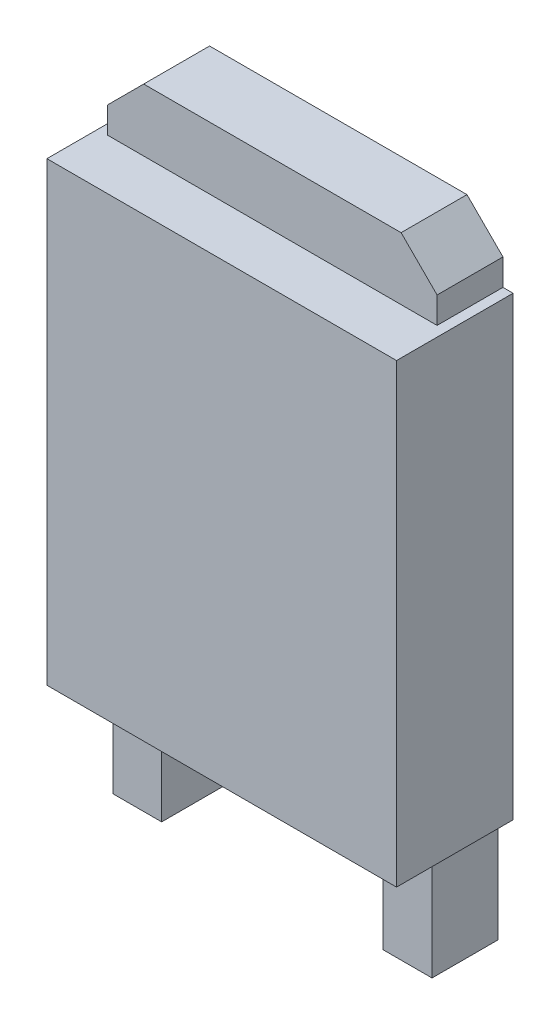
ISO-10303-21;
HEADER;
FILE_DESCRIPTION(('STEP AP214'),'2;1');
FILE_NAME('part.step','',(''),(''),'','','');
FILE_SCHEMA(('AUTOMOTIVE_DESIGN { 1 0 10303 214 1 1 1 1 }'));
ENDSEC;
DATA;
#1=APPLICATION_CONTEXT('core data for automotive mechanical design processes');
#2=APPLICATION_PROTOCOL_DEFINITION('international standard','automotive_design',2000,#1);
#3=PRODUCT_CONTEXT('',#1,'mechanical');
#4=PRODUCT('Part','Part','',(#3));
#5=PRODUCT_RELATED_PRODUCT_CATEGORY('part','',(#4));
#6=PRODUCT_DEFINITION_FORMATION('','',#4);
#7=PRODUCT_DEFINITION_CONTEXT('part definition',#1,'design');
#8=PRODUCT_DEFINITION('design','',#6,#7);
#9=PRODUCT_DEFINITION_SHAPE('','',#8);
#10=(LENGTH_UNIT() NAMED_UNIT(*) SI_UNIT(.MILLI.,.METRE.));
#11=(NAMED_UNIT(*) PLANE_ANGLE_UNIT() SI_UNIT($,.RADIAN.));
#12=(NAMED_UNIT(*) SI_UNIT($,.STERADIAN.) SOLID_ANGLE_UNIT());
#13=UNCERTAINTY_MEASURE_WITH_UNIT(LENGTH_MEASURE(1.E-05),#10,'distance_accuracy_value','');
#14=(GEOMETRIC_REPRESENTATION_CONTEXT(3) GLOBAL_UNCERTAINTY_ASSIGNED_CONTEXT((#13)) GLOBAL_UNIT_ASSIGNED_CONTEXT((#10,
#11,#12)) REPRESENTATION_CONTEXT('',''));
#15=CARTESIAN_POINT('',(0.,0.,0.));
#16=DIRECTION('',(0.,0.,1.));
#17=DIRECTION('',(1.,0.,0.));
#18=AXIS2_PLACEMENT_3D('',#15,#16,#17);
#19=CARTESIAN_POINT('',(0.,0.,0.));
#20=DIRECTION('',(0.,0.,-1.));
#21=DIRECTION('',(-1.,0.,0.));
#22=AXIS2_PLACEMENT_3D('',#19,#20,#21);
#23=PLANE('',#22);
#24=DIRECTION('',(1.,0.,0.));
#25=VECTOR('',#24,1.);
#26=CARTESIAN_POINT('',(-3.45,-4.5,0.));
#27=LINE('',#26,#25);
#28=CARTESIAN_POINT('',(-2.18529638091924,-4.5,0.));
#29=VERTEX_POINT('',#28);
#30=CARTESIAN_POINT('',(2.18529638091924,-4.5,0.));
#31=VERTEX_POINT('',#30);
#32=EDGE_CURVE('E346',#29,#31,#27,.T.);
#33=ORIENTED_EDGE('',*,*,#32,.F.);
#34=DIRECTION('',(1.,0.,0.));
#35=VECTOR('',#34,1.);
#36=CARTESIAN_POINT('',(-2.18529638091924,-4.5,0.));
#37=LINE('',#36,#35);
#38=CARTESIAN_POINT('',(-3.15,-4.5,0.));
#39=VERTEX_POINT('',#38);
#40=EDGE_CURVE('E204',#39,#29,#37,.T.);
#41=ORIENTED_EDGE('',*,*,#40,.F.);
#42=CARTESIAN_POINT('',(-3.45,-4.5,0.));
#43=VERTEX_POINT('',#42);
#44=EDGE_CURVE('E329',#43,#39,#27,.T.);
#45=ORIENTED_EDGE('',*,*,#44,.F.);
#46=DIRECTION('',(0.,-1.,0.));
#47=VECTOR('',#46,1.);
#48=CARTESIAN_POINT('',(-3.45,-4.5,0.));
#49=LINE('',#48,#47);
#50=CARTESIAN_POINT('',(-3.45,4.5,0.));
#51=VERTEX_POINT('',#50);
#52=EDGE_CURVE('E342',#51,#43,#49,.T.);
#53=ORIENTED_EDGE('',*,*,#52,.F.);
#54=DIRECTION('',(-1.,0.,0.));
#55=VECTOR('',#54,1.);
#56=CARTESIAN_POINT('',(-3.45,4.5,0.));
#57=LINE('',#56,#55);
#58=CARTESIAN_POINT('',(-3.25,4.5,0.));
#59=VERTEX_POINT('',#58);
#60=EDGE_CURVE('E338',#59,#51,#57,.T.);
#61=ORIENTED_EDGE('',*,*,#60,.F.);
#62=DIRECTION('',(-1.,0.,0.));
#63=VECTOR('',#62,1.);
#64=CARTESIAN_POINT('',(-3.25,4.5,0.));
#65=LINE('',#64,#63);
#66=CARTESIAN_POINT('',(3.25,4.5,0.));
#67=VERTEX_POINT('',#66);
#68=EDGE_CURVE('E235',#67,#59,#65,.T.);
#69=ORIENTED_EDGE('',*,*,#68,.F.);
#70=CARTESIAN_POINT('',(3.45,4.5,0.));
#71=VERTEX_POINT('',#70);
#72=EDGE_CURVE('E339',#71,#67,#57,.T.);
#73=ORIENTED_EDGE('',*,*,#72,.F.);
#74=DIRECTION('',(0.,1.,0.));
#75=VECTOR('',#74,1.);
#76=CARTESIAN_POINT('',(3.45,-4.5,0.));
#77=LINE('',#76,#75);
#78=CARTESIAN_POINT('',(3.45,-4.5,0.));
#79=VERTEX_POINT('',#78);
#80=EDGE_CURVE('E314',#79,#71,#77,.T.);
#81=ORIENTED_EDGE('',*,*,#80,.F.);
#82=CARTESIAN_POINT('',(3.15,-4.5,0.));
#83=VERTEX_POINT('',#82);
#84=EDGE_CURVE('E344',#83,#79,#27,.T.);
#85=ORIENTED_EDGE('',*,*,#84,.F.);
#86=DIRECTION('',(1.,0.,0.));
#87=VECTOR('',#86,1.);
#88=CARTESIAN_POINT('',(3.15,-4.5,0.));
#89=LINE('',#88,#87);
#90=EDGE_CURVE('E216',#31,#83,#89,.T.);
#91=ORIENTED_EDGE('',*,*,#90,.F.);
#92=EDGE_LOOP('',(#33,#41,#45,#53,#61,#69,#73,#81,#85,#91));
#93=FACE_BOUND('',#92,.T.);
#94=ADVANCED_FACE('F36',(#93),#23,.T.);
#95=CARTESIAN_POINT('',(-3.45,-4.5,2.3));
#96=DIRECTION('',(0.,1.,0.));
#97=DIRECTION('',(0.,0.,1.));
#98=AXIS2_PLACEMENT_3D('',#95,#96,#97);
#99=PLANE('',#98);
#100=ORIENTED_EDGE('',*,*,#44,.T.);
#101=DIRECTION('',(0.,0.,-1.));
#102=VECTOR('',#101,1.);
#103=CARTESIAN_POINT('',(-3.15,-4.5,1.3));
#104=LINE('',#103,#102);
#105=CARTESIAN_POINT('',(-3.15,-4.5,1.3));
#106=VERTEX_POINT('',#105);
#107=EDGE_CURVE('E56',#106,#39,#104,.T.);
#108=ORIENTED_EDGE('',*,*,#107,.F.);
#109=DIRECTION('',(1.,0.,0.));
#110=VECTOR('',#109,1.);
#111=CARTESIAN_POINT('',(-3.15,-4.5,1.3));
#112=LINE('',#111,#110);
#113=CARTESIAN_POINT('',(-2.18529638091924,-4.5,1.3));
#114=VERTEX_POINT('',#113);
#115=EDGE_CURVE('E51',#106,#114,#112,.T.);
#116=ORIENTED_EDGE('',*,*,#115,.T.);
#117=DIRECTION('',(0.,0.,-1.));
#118=VECTOR('',#117,1.);
#119=CARTESIAN_POINT('',(-2.18529638091924,-4.5,1.3));
#120=LINE('',#119,#118);
#121=EDGE_CURVE('E191',#114,#29,#120,.T.);
#122=ORIENTED_EDGE('',*,*,#121,.T.);
#123=ORIENTED_EDGE('',*,*,#32,.T.);
#124=DIRECTION('',(0.,0.,-1.));
#125=VECTOR('',#124,1.);
#126=CARTESIAN_POINT('',(2.18529638091924,-4.5,1.3));
#127=LINE('',#126,#125);
#128=CARTESIAN_POINT('',(2.18529638091924,-4.5,1.3));
#129=VERTEX_POINT('',#128);
#130=EDGE_CURVE('E284',#129,#31,#127,.T.);
#131=ORIENTED_EDGE('',*,*,#130,.F.);
#132=DIRECTION('',(1.,0.,0.));
#133=VECTOR('',#132,1.);
#134=CARTESIAN_POINT('',(3.15,-4.5,1.3));
#135=LINE('',#134,#133);
#136=CARTESIAN_POINT('',(3.15,-4.5,1.3));
#137=VERTEX_POINT('',#136);
#138=EDGE_CURVE('E269',#129,#137,#135,.T.);
#139=ORIENTED_EDGE('',*,*,#138,.T.);
#140=DIRECTION('',(0.,0.,-1.));
#141=VECTOR('',#140,1.);
#142=CARTESIAN_POINT('',(3.15,-4.5,1.3));
#143=LINE('',#142,#141);
#144=EDGE_CURVE('E283',#137,#83,#143,.T.);
#145=ORIENTED_EDGE('',*,*,#144,.T.);
#146=ORIENTED_EDGE('',*,*,#84,.T.);
#147=DIRECTION('',(0.,0.,-1.));
#148=VECTOR('',#147,1.);
#149=CARTESIAN_POINT('',(3.45,-4.5,2.3));
#150=LINE('',#149,#148);
#151=CARTESIAN_POINT('',(3.45,-4.5,2.3));
#152=VERTEX_POINT('',#151);
#153=EDGE_CURVE('E335',#152,#79,#150,.T.);
#154=ORIENTED_EDGE('',*,*,#153,.F.);
#155=DIRECTION('',(1.,0.,0.));
#156=VECTOR('',#155,1.);
#157=CARTESIAN_POINT('',(-3.45,-4.5,2.3));
#158=LINE('',#157,#156);
#159=CARTESIAN_POINT('',(-3.45,-4.5,2.3));
#160=VERTEX_POINT('',#159);
#161=EDGE_CURVE('E333',#160,#152,#158,.T.);
#162=ORIENTED_EDGE('',*,*,#161,.F.);
#163=DIRECTION('',(0.,0.,-1.));
#164=VECTOR('',#163,1.);
#165=CARTESIAN_POINT('',(-3.45,-4.5,2.3));
#166=LINE('',#165,#164);
#167=EDGE_CURVE('E349',#160,#43,#166,.T.);
#168=ORIENTED_EDGE('',*,*,#167,.T.);
#169=EDGE_LOOP('',(#100,#108,#116,#122,#123,#131,#139,#145,#146,#154,#162,#168));
#170=FACE_BOUND('',#169,.T.);
#171=ADVANCED_FACE('F361',(#170),#99,.F.);
#172=CARTESIAN_POINT('',(-3.45,4.5,2.3));
#173=DIRECTION('',(0.,-1.,0.));
#174=DIRECTION('',(0.,0.,-1.));
#175=AXIS2_PLACEMENT_3D('',#172,#173,#174);
#176=PLANE('',#175);
#177=DIRECTION('',(0.,0.,-1.));
#178=VECTOR('',#177,1.);
#179=CARTESIAN_POINT('',(3.25,4.5,1.3));
#180=LINE('',#179,#178);
#181=CARTESIAN_POINT('',(3.25,4.5,1.3));
#182=VERTEX_POINT('',#181);
#183=EDGE_CURVE('E311',#182,#67,#180,.T.);
#184=ORIENTED_EDGE('',*,*,#183,.F.);
#185=DIRECTION('',(-1.,0.,0.));
#186=VECTOR('',#185,1.);
#187=CARTESIAN_POINT('',(3.25,4.5,1.3));
#188=LINE('',#187,#186);
#189=CARTESIAN_POINT('',(-3.25,4.5,1.3));
#190=VERTEX_POINT('',#189);
#191=EDGE_CURVE('E287',#182,#190,#188,.T.);
#192=ORIENTED_EDGE('',*,*,#191,.T.);
#193=DIRECTION('',(0.,0.,-1.));
#194=VECTOR('',#193,1.);
#195=CARTESIAN_POINT('',(-3.25,4.5,1.3));
#196=LINE('',#195,#194);
#197=EDGE_CURVE('E310',#190,#59,#196,.T.);
#198=ORIENTED_EDGE('',*,*,#197,.T.);
#199=ORIENTED_EDGE('',*,*,#60,.T.);
#200=DIRECTION('',(0.,0.,-1.));
#201=VECTOR('',#200,1.);
#202=CARTESIAN_POINT('',(-3.45,4.5,2.3));
#203=LINE('',#202,#201);
#204=CARTESIAN_POINT('',(-3.45,4.5,2.3));
#205=VERTEX_POINT('',#204);
#206=EDGE_CURVE('E44',#205,#51,#203,.T.);
#207=ORIENTED_EDGE('',*,*,#206,.F.);
#208=DIRECTION('',(-1.,0.,0.));
#209=VECTOR('',#208,1.);
#210=CARTESIAN_POINT('',(-3.45,4.5,2.3));
#211=LINE('',#210,#209);
#212=CARTESIAN_POINT('',(3.45,4.5,2.3));
#213=VERTEX_POINT('',#212);
#214=EDGE_CURVE('E328',#213,#205,#211,.T.);
#215=ORIENTED_EDGE('',*,*,#214,.F.);
#216=DIRECTION('',(0.,0.,-1.));
#217=VECTOR('',#216,1.);
#218=CARTESIAN_POINT('',(3.45,4.5,2.3));
#219=LINE('',#218,#217);
#220=EDGE_CURVE('E11',#213,#71,#219,.T.);
#221=ORIENTED_EDGE('',*,*,#220,.T.);
#222=ORIENTED_EDGE('',*,*,#72,.T.);
#223=EDGE_LOOP('',(#184,#192,#198,#199,#207,#215,#221,#222));
#224=FACE_BOUND('',#223,.T.);
#225=ADVANCED_FACE('F389',(#224),#176,.F.);
#226=CARTESIAN_POINT('',(3.45,-4.5,2.3));
#227=DIRECTION('',(-1.,0.,0.));
#228=DIRECTION('',(0.,0.,1.));
#229=AXIS2_PLACEMENT_3D('',#226,#227,#228);
#230=PLANE('',#229);
#231=ORIENTED_EDGE('',*,*,#80,.T.);
#232=ORIENTED_EDGE('',*,*,#220,.F.);
#233=DIRECTION('',(0.,1.,0.));
#234=VECTOR('',#233,1.);
#235=CARTESIAN_POINT('',(3.45,-4.5,2.3));
#236=LINE('',#235,#234);
#237=EDGE_CURVE('E325',#152,#213,#236,.T.);
#238=ORIENTED_EDGE('',*,*,#237,.F.);
#239=ORIENTED_EDGE('',*,*,#153,.T.);
#240=EDGE_LOOP('',(#231,#232,#238,#239));
#241=FACE_BOUND('',#240,.T.);
#242=ADVANCED_FACE('F38',(#241),#230,.F.);
#243=CARTESIAN_POINT('',(-3.45,-4.5,2.3));
#244=DIRECTION('',(1.,0.,0.));
#245=DIRECTION('',(0.,0.,-1.));
#246=AXIS2_PLACEMENT_3D('',#243,#244,#245);
#247=PLANE('',#246);
#248=ORIENTED_EDGE('',*,*,#52,.T.);
#249=ORIENTED_EDGE('',*,*,#167,.F.);
#250=DIRECTION('',(0.,-1.,0.));
#251=VECTOR('',#250,1.);
#252=CARTESIAN_POINT('',(-3.45,-4.5,2.3));
#253=LINE('',#252,#251);
#254=EDGE_CURVE('E331',#205,#160,#253,.T.);
#255=ORIENTED_EDGE('',*,*,#254,.F.);
#256=ORIENTED_EDGE('',*,*,#206,.T.);
#257=EDGE_LOOP('',(#248,#249,#255,#256));
#258=FACE_BOUND('',#257,.T.);
#259=ADVANCED_FACE('F356',(#258),#247,.F.);
#260=CARTESIAN_POINT('',(0.,0.,2.3));
#261=DIRECTION('',(0.,0.,-1.));
#262=DIRECTION('',(-1.,0.,0.));
#263=AXIS2_PLACEMENT_3D('',#260,#261,#262);
#264=PLANE('',#263);
#265=ORIENTED_EDGE('',*,*,#237,.T.);
#266=ORIENTED_EDGE('',*,*,#214,.T.);
#267=ORIENTED_EDGE('',*,*,#254,.T.);
#268=ORIENTED_EDGE('',*,*,#161,.T.);
#269=EDGE_LOOP('',(#265,#266,#267,#268));
#270=FACE_BOUND('',#269,.T.);
#271=ADVANCED_FACE('F392',(#270),#264,.F.);
#272=CARTESIAN_POINT('',(3.25,5.02042326251558,1.3));
#273=DIRECTION('',(1.,0.,0.));
#274=DIRECTION('',(0.,0.,-1.));
#275=AXIS2_PLACEMENT_3D('',#272,#273,#274);
#276=PLANE('',#275);
#277=ORIENTED_EDGE('',*,*,#183,.T.);
#278=DIRECTION('',(0.,0.,1.));
#279=VECTOR('',#278,1.);
#280=CARTESIAN_POINT('',(3.25,4.5,-0.0001));
#281=LINE('',#280,#279);
#282=CARTESIAN_POINT('',(3.25,4.5,-0.0001));
#283=VERTEX_POINT('',#282);
#284=EDGE_CURVE('E253',#283,#67,#281,.T.);
#285=ORIENTED_EDGE('',*,*,#284,.F.);
#286=DIRECTION('',(0.,-1.,0.));
#287=VECTOR('',#286,1.);
#288=CARTESIAN_POINT('',(3.25,4.5,-0.0001));
#289=LINE('',#288,#287);
#290=CARTESIAN_POINT('',(3.25,5.02042326251558,-0.0001));
#291=VERTEX_POINT('',#290);
#292=EDGE_CURVE('E251',#291,#283,#289,.T.);
#293=ORIENTED_EDGE('',*,*,#292,.F.);
#294=DIRECTION('',(0.,0.,-1.));
#295=VECTOR('',#294,1.);
#296=CARTESIAN_POINT('',(3.25,5.02042326251558,1.3));
#297=LINE('',#296,#295);
#298=CARTESIAN_POINT('',(3.25,5.02042326251558,1.3));
#299=VERTEX_POINT('',#298);
#300=EDGE_CURVE('E315',#299,#291,#297,.T.);
#301=ORIENTED_EDGE('',*,*,#300,.F.);
#302=DIRECTION('',(0.,-1.,0.));
#303=VECTOR('',#302,1.);
#304=CARTESIAN_POINT('',(3.25,5.02042326251558,1.3));
#305=LINE('',#304,#303);
#306=EDGE_CURVE('E307',#299,#182,#305,.T.);
#307=ORIENTED_EDGE('',*,*,#306,.T.);
#308=EDGE_LOOP('',(#277,#285,#293,#301,#307));
#309=FACE_BOUND('',#308,.T.);
#310=ADVANCED_FACE('F404',(#309),#276,.T.);
#311=CARTESIAN_POINT('',(2.54,5.73042326251558,1.3));
#312=DIRECTION('',(0.707106781186547,0.707106781186548,0.));
#313=DIRECTION('',(-0.707106781186548,0.707106781186547,0.));
#314=AXIS2_PLACEMENT_3D('',#311,#312,#313);
#315=PLANE('',#314);
#316=ORIENTED_EDGE('',*,*,#300,.T.);
#317=DIRECTION('',(0.707106781186548,-0.707106781186547,0.));
#318=VECTOR('',#317,1.);
#319=CARTESIAN_POINT('',(3.25,5.02042326251558,-0.0001));
#320=LINE('',#319,#318);
#321=CARTESIAN_POINT('',(2.54,5.73042326251558,-0.0001));
#322=VERTEX_POINT('',#321);
#323=EDGE_CURVE('E248',#322,#291,#320,.T.);
#324=ORIENTED_EDGE('',*,*,#323,.F.);
#325=DIRECTION('',(0.,0.,-1.));
#326=VECTOR('',#325,1.);
#327=CARTESIAN_POINT('',(2.54,5.73042326251558,1.3));
#328=LINE('',#327,#326);
#329=CARTESIAN_POINT('',(2.54,5.73042326251558,1.3));
#330=VERTEX_POINT('',#329);
#331=EDGE_CURVE('E317',#330,#322,#328,.T.);
#332=ORIENTED_EDGE('',*,*,#331,.F.);
#333=DIRECTION('',(0.707106781186548,-0.707106781186547,0.));
#334=VECTOR('',#333,1.);
#335=CARTESIAN_POINT('',(2.54,5.73042326251558,1.3));
#336=LINE('',#335,#334);
#337=EDGE_CURVE('E304',#330,#299,#336,.T.);
#338=ORIENTED_EDGE('',*,*,#337,.T.);
#339=EDGE_LOOP('',(#316,#324,#332,#338));
#340=FACE_BOUND('',#339,.T.);
#341=ADVANCED_FACE('F458',(#340),#315,.T.);
#342=CARTESIAN_POINT('',(-2.54,5.73042326251558,1.3));
#343=DIRECTION('',(0.,1.,0.));
#344=DIRECTION('',(-1.,0.,0.));
#345=AXIS2_PLACEMENT_3D('',#342,#343,#344);
#346=PLANE('',#345);
#347=ORIENTED_EDGE('',*,*,#331,.T.);
#348=DIRECTION('',(1.,0.,0.));
#349=VECTOR('',#348,1.);
#350=CARTESIAN_POINT('',(2.54,5.73042326251558,-0.0001));
#351=LINE('',#350,#349);
#352=CARTESIAN_POINT('',(-2.54,5.73042326251558,-0.0001));
#353=VERTEX_POINT('',#352);
#354=EDGE_CURVE('E245',#353,#322,#351,.T.);
#355=ORIENTED_EDGE('',*,*,#354,.F.);
#356=DIRECTION('',(0.,0.,-1.));
#357=VECTOR('',#356,1.);
#358=CARTESIAN_POINT('',(-2.54,5.73042326251558,1.3));
#359=LINE('',#358,#357);
#360=CARTESIAN_POINT('',(-2.54,5.73042326251558,1.3));
#361=VERTEX_POINT('',#360);
#362=EDGE_CURVE('E319',#361,#353,#359,.T.);
#363=ORIENTED_EDGE('',*,*,#362,.F.);
#364=DIRECTION('',(1.,0.,0.));
#365=VECTOR('',#364,1.);
#366=CARTESIAN_POINT('',(-2.54,5.73042326251558,1.3));
#367=LINE('',#366,#365);
#368=EDGE_CURVE('E301',#361,#330,#367,.T.);
#369=ORIENTED_EDGE('',*,*,#368,.T.);
#370=EDGE_LOOP('',(#347,#355,#363,#369));
#371=FACE_BOUND('',#370,.T.);
#372=ADVANCED_FACE('F461',(#371),#346,.T.);
#373=CARTESIAN_POINT('',(-3.25,5.02042326251558,1.3));
#374=DIRECTION('',(-0.707106781186548,0.707106781186548,0.));
#375=DIRECTION('',(-0.707106781186548,-0.707106781186548,0.));
#376=AXIS2_PLACEMENT_3D('',#373,#374,#375);
#377=PLANE('',#376);
#378=ORIENTED_EDGE('',*,*,#362,.T.);
#379=DIRECTION('',(0.707106781186547,0.707106781186547,0.));
#380=VECTOR('',#379,1.);
#381=CARTESIAN_POINT('',(-2.54,5.73042326251558,-0.0001));
#382=LINE('',#381,#380);
#383=CARTESIAN_POINT('',(-3.25,5.02042326251558,-0.0001));
#384=VERTEX_POINT('',#383);
#385=EDGE_CURVE('E242',#384,#353,#382,.T.);
#386=ORIENTED_EDGE('',*,*,#385,.F.);
#387=DIRECTION('',(0.,0.,-1.));
#388=VECTOR('',#387,1.);
#389=CARTESIAN_POINT('',(-3.25,5.02042326251558,1.3));
#390=LINE('',#389,#388);
#391=CARTESIAN_POINT('',(-3.25,5.02042326251558,1.3));
#392=VERTEX_POINT('',#391);
#393=EDGE_CURVE('E321',#392,#384,#390,.T.);
#394=ORIENTED_EDGE('',*,*,#393,.F.);
#395=DIRECTION('',(0.707106781186547,0.707106781186547,0.));
#396=VECTOR('',#395,1.);
#397=CARTESIAN_POINT('',(-3.25,5.02042326251558,1.3));
#398=LINE('',#397,#396);
#399=EDGE_CURVE('E298',#392,#361,#398,.T.);
#400=ORIENTED_EDGE('',*,*,#399,.T.);
#401=EDGE_LOOP('',(#378,#386,#394,#400));
#402=FACE_BOUND('',#401,.T.);
#403=ADVANCED_FACE('F465',(#402),#377,.T.);
#404=CARTESIAN_POINT('',(-3.25,4.5,1.3));
#405=DIRECTION('',(-1.,0.,0.));
#406=DIRECTION('',(0.,0.,1.));
#407=AXIS2_PLACEMENT_3D('',#404,#405,#406);
#408=PLANE('',#407);
#409=ORIENTED_EDGE('',*,*,#393,.T.);
#410=DIRECTION('',(0.,1.,0.));
#411=VECTOR('',#410,1.);
#412=CARTESIAN_POINT('',(-3.25,5.02042326251558,-0.0001));
#413=LINE('',#412,#411);
#414=CARTESIAN_POINT('',(-3.25,4.5,-0.0001));
#415=VERTEX_POINT('',#414);
#416=EDGE_CURVE('E239',#415,#384,#413,.T.);
#417=ORIENTED_EDGE('',*,*,#416,.F.);
#418=DIRECTION('',(0.,0.,1.));
#419=VECTOR('',#418,1.);
#420=CARTESIAN_POINT('',(-3.25,4.5,-0.0001));
#421=LINE('',#420,#419);
#422=EDGE_CURVE('E258',#415,#59,#421,.T.);
#423=ORIENTED_EDGE('',*,*,#422,.T.);
#424=ORIENTED_EDGE('',*,*,#197,.F.);
#425=DIRECTION('',(0.,1.,0.));
#426=VECTOR('',#425,1.);
#427=CARTESIAN_POINT('',(-3.25,4.5,1.3));
#428=LINE('',#427,#426);
#429=EDGE_CURVE('E295',#190,#392,#428,.T.);
#430=ORIENTED_EDGE('',*,*,#429,.T.);
#431=EDGE_LOOP('',(#409,#417,#423,#424,#430));
#432=FACE_BOUND('',#431,.T.);
#433=ADVANCED_FACE('F415',(#432),#408,.T.);
#434=CARTESIAN_POINT('',(0.,0.,1.3));
#435=DIRECTION('',(0.,0.,-1.));
#436=DIRECTION('',(-1.,0.,0.));
#437=AXIS2_PLACEMENT_3D('',#434,#435,#436);
#438=PLANE('',#437);
#439=ORIENTED_EDGE('',*,*,#191,.F.);
#440=ORIENTED_EDGE('',*,*,#306,.F.);
#441=ORIENTED_EDGE('',*,*,#337,.F.);
#442=ORIENTED_EDGE('',*,*,#368,.F.);
#443=ORIENTED_EDGE('',*,*,#399,.F.);
#444=ORIENTED_EDGE('',*,*,#429,.F.);
#445=EDGE_LOOP('',(#439,#440,#441,#442,#443,#444));
#446=FACE_BOUND('',#445,.T.);
#447=ADVANCED_FACE('F410',(#446),#438,.F.);
#448=CARTESIAN_POINT('',(2.18529638091924,-6.70308501338229,1.3));
#449=DIRECTION('',(-1.,0.,0.));
#450=DIRECTION('',(0.,0.,1.));
#451=AXIS2_PLACEMENT_3D('',#448,#449,#450);
#452=PLANE('',#451);
#453=ORIENTED_EDGE('',*,*,#130,.T.);
#454=DIRECTION('',(0.,0.,1.));
#455=VECTOR('',#454,1.);
#456=CARTESIAN_POINT('',(2.18529638091924,-4.5,-0.0001));
#457=LINE('',#456,#455);
#458=CARTESIAN_POINT('',(2.18529638091924,-4.5,-0.0001));
#459=VERTEX_POINT('',#458);
#460=EDGE_CURVE('E232',#459,#31,#457,.T.);
#461=ORIENTED_EDGE('',*,*,#460,.F.);
#462=DIRECTION('',(0.,1.,0.));
#463=VECTOR('',#462,1.);
#464=CARTESIAN_POINT('',(2.18529638091924,-4.5,-0.0001));
#465=LINE('',#464,#463);
#466=CARTESIAN_POINT('',(2.18529638091924,-6.70308501338229,-0.0001));
#467=VERTEX_POINT('',#466);
#468=EDGE_CURVE('E223',#467,#459,#465,.T.);
#469=ORIENTED_EDGE('',*,*,#468,.F.);
#470=DIRECTION('',(0.,0.,-1.));
#471=VECTOR('',#470,1.);
#472=CARTESIAN_POINT('',(2.18529638091924,-6.70308501338229,1.3));
#473=LINE('',#472,#471);
#474=CARTESIAN_POINT('',(2.18529638091924,-6.70308501338229,1.3));
#475=VERTEX_POINT('',#474);
#476=EDGE_CURVE('E288',#475,#467,#473,.T.);
#477=ORIENTED_EDGE('',*,*,#476,.F.);
#478=DIRECTION('',(0.,1.,0.));
#479=VECTOR('',#478,1.);
#480=CARTESIAN_POINT('',(2.18529638091924,-6.70308501338229,1.3));
#481=LINE('',#480,#479);
#482=EDGE_CURVE('E280',#475,#129,#481,.T.);
#483=ORIENTED_EDGE('',*,*,#482,.T.);
#484=EDGE_LOOP('',(#453,#461,#469,#477,#483));
#485=FACE_BOUND('',#484,.T.);
#486=ADVANCED_FACE('F425',(#485),#452,.T.);
#487=CARTESIAN_POINT('',(3.15,-6.70308501338229,1.3));
#488=DIRECTION('',(0.,-1.,0.));
#489=DIRECTION('',(0.,0.,-1.));
#490=AXIS2_PLACEMENT_3D('',#487,#488,#489);
#491=PLANE('',#490);
#492=ORIENTED_EDGE('',*,*,#476,.T.);
#493=DIRECTION('',(-1.,0.,0.));
#494=VECTOR('',#493,1.);
#495=CARTESIAN_POINT('',(2.18529638091924,-6.70308501338229,-0.0001));
#496=LINE('',#495,#494);
#497=CARTESIAN_POINT('',(3.15,-6.70308501338229,-0.0001));
#498=VERTEX_POINT('',#497);
#499=EDGE_CURVE('E220',#498,#467,#496,.T.);
#500=ORIENTED_EDGE('',*,*,#499,.F.);
#501=DIRECTION('',(0.,0.,-1.));
#502=VECTOR('',#501,1.);
#503=CARTESIAN_POINT('',(3.15,-6.70308501338229,1.3));
#504=LINE('',#503,#502);
#505=CARTESIAN_POINT('',(3.15,-6.70308501338229,1.3));
#506=VERTEX_POINT('',#505);
#507=EDGE_CURVE('E290',#506,#498,#504,.T.);
#508=ORIENTED_EDGE('',*,*,#507,.F.);
#509=DIRECTION('',(-1.,0.,0.));
#510=VECTOR('',#509,1.);
#511=CARTESIAN_POINT('',(3.15,-6.70308501338229,1.3));
#512=LINE('',#511,#510);
#513=EDGE_CURVE('E277',#506,#475,#512,.T.);
#514=ORIENTED_EDGE('',*,*,#513,.T.);
#515=EDGE_LOOP('',(#492,#500,#508,#514));
#516=FACE_BOUND('',#515,.T.);
#517=ADVANCED_FACE('F438',(#516),#491,.T.);
#518=CARTESIAN_POINT('',(3.15,-4.5,1.3));
#519=DIRECTION('',(1.,0.,0.));
#520=DIRECTION('',(0.,0.,-1.));
#521=AXIS2_PLACEMENT_3D('',#518,#519,#520);
#522=PLANE('',#521);
#523=ORIENTED_EDGE('',*,*,#507,.T.);
#524=DIRECTION('',(0.,-1.,0.));
#525=VECTOR('',#524,1.);
#526=CARTESIAN_POINT('',(3.15,-6.70308501338229,-0.0001));
#527=LINE('',#526,#525);
#528=CARTESIAN_POINT('',(3.15,-4.5,-0.0001));
#529=VERTEX_POINT('',#528);
#530=EDGE_CURVE('E217',#529,#498,#527,.T.);
#531=ORIENTED_EDGE('',*,*,#530,.F.);
#532=DIRECTION('',(0.,0.,1.));
#533=VECTOR('',#532,1.);
#534=CARTESIAN_POINT('',(3.15,-4.5,-0.0001));
#535=LINE('',#534,#533);
#536=EDGE_CURVE('E227',#529,#83,#535,.T.);
#537=ORIENTED_EDGE('',*,*,#536,.T.);
#538=ORIENTED_EDGE('',*,*,#144,.F.);
#539=DIRECTION('',(0.,-1.,0.));
#540=VECTOR('',#539,1.);
#541=CARTESIAN_POINT('',(3.15,-4.5,1.3));
#542=LINE('',#541,#540);
#543=EDGE_CURVE('E274',#137,#506,#542,.T.);
#544=ORIENTED_EDGE('',*,*,#543,.T.);
#545=EDGE_LOOP('',(#523,#531,#537,#538,#544));
#546=FACE_BOUND('',#545,.T.);
#547=ADVANCED_FACE('F443',(#546),#522,.T.);
#548=CARTESIAN_POINT('',(0.,0.,1.3));
#549=DIRECTION('',(0.,0.,-1.));
#550=DIRECTION('',(-1.,0.,0.));
#551=AXIS2_PLACEMENT_3D('',#548,#549,#550);
#552=PLANE('',#551);
#553=ORIENTED_EDGE('',*,*,#138,.F.);
#554=ORIENTED_EDGE('',*,*,#482,.F.);
#555=ORIENTED_EDGE('',*,*,#513,.F.);
#556=ORIENTED_EDGE('',*,*,#543,.F.);
#557=EDGE_LOOP('',(#553,#554,#555,#556));
#558=FACE_BOUND('',#557,.T.);
#559=ADVANCED_FACE('F441',(#558),#552,.F.);
#560=CARTESIAN_POINT('',(-3.15,-4.5,1.3));
#561=DIRECTION('',(-1.,0.,0.));
#562=DIRECTION('',(0.,0.,1.));
#563=AXIS2_PLACEMENT_3D('',#560,#561,#562);
#564=PLANE('',#563);
#565=ORIENTED_EDGE('',*,*,#107,.T.);
#566=DIRECTION('',(0.,0.,1.));
#567=VECTOR('',#566,1.);
#568=CARTESIAN_POINT('',(-3.15,-4.5,-0.0001));
#569=LINE('',#568,#567);
#570=CARTESIAN_POINT('',(-3.15,-4.5,-0.0001));
#571=VERTEX_POINT('',#570);
#572=EDGE_CURVE('E213',#571,#39,#569,.T.);
#573=ORIENTED_EDGE('',*,*,#572,.F.);
#574=DIRECTION('',(0.,1.,0.));
#575=VECTOR('',#574,1.);
#576=CARTESIAN_POINT('',(-3.15,-4.5,-0.0001));
#577=LINE('',#576,#575);
#578=CARTESIAN_POINT('',(-3.15,-6.70308501338229,-0.0001));
#579=VERTEX_POINT('',#578);
#580=EDGE_CURVE('E198',#579,#571,#577,.T.);
#581=ORIENTED_EDGE('',*,*,#580,.F.);
#582=DIRECTION('',(0.,0.,-1.));
#583=VECTOR('',#582,1.);
#584=CARTESIAN_POINT('',(-3.15,-6.70308501338229,1.3));
#585=LINE('',#584,#583);
#586=CARTESIAN_POINT('',(-3.15,-6.70308501338229,1.3));
#587=VERTEX_POINT('',#586);
#588=EDGE_CURVE('E190',#587,#579,#585,.T.);
#589=ORIENTED_EDGE('',*,*,#588,.F.);
#590=DIRECTION('',(0.,1.,0.));
#591=VECTOR('',#590,1.);
#592=CARTESIAN_POINT('',(-3.15,-4.5,1.3));
#593=LINE('',#592,#591);
#594=EDGE_CURVE('E265',#587,#106,#593,.T.);
#595=ORIENTED_EDGE('',*,*,#594,.T.);
#596=EDGE_LOOP('',(#565,#573,#581,#589,#595));
#597=FACE_BOUND('',#596,.T.);
#598=ADVANCED_FACE('F365',(#597),#564,.T.);
#599=CARTESIAN_POINT('',(-3.15,-6.70308501338229,1.3));
#600=DIRECTION('',(0.,-1.,0.));
#601=DIRECTION('',(0.,0.,-1.));
#602=AXIS2_PLACEMENT_3D('',#599,#600,#601);
#603=PLANE('',#602);
#604=ORIENTED_EDGE('',*,*,#588,.T.);
#605=DIRECTION('',(-1.,0.,0.));
#606=VECTOR('',#605,1.);
#607=CARTESIAN_POINT('',(-3.15,-6.70308501338229,-0.0001));
#608=LINE('',#607,#606);
#609=CARTESIAN_POINT('',(-2.18529638091924,-6.70308501338229,-0.0001));
#610=VERTEX_POINT('',#609);
#611=EDGE_CURVE('E194',#610,#579,#608,.T.);
#612=ORIENTED_EDGE('',*,*,#611,.F.);
#613=DIRECTION('',(0.,0.,-1.));
#614=VECTOR('',#613,1.);
#615=CARTESIAN_POINT('',(-2.18529638091924,-6.70308501338229,1.3));
#616=LINE('',#615,#614);
#617=CARTESIAN_POINT('',(-2.18529638091924,-6.70308501338229,1.3));
#618=VERTEX_POINT('',#617);
#619=EDGE_CURVE('E179',#618,#610,#616,.T.);
#620=ORIENTED_EDGE('',*,*,#619,.F.);
#621=DIRECTION('',(-1.,0.,0.));
#622=VECTOR('',#621,1.);
#623=CARTESIAN_POINT('',(-3.15,-6.70308501338229,1.3));
#624=LINE('',#623,#622);
#625=EDGE_CURVE('E263',#618,#587,#624,.T.);
#626=ORIENTED_EDGE('',*,*,#625,.T.);
#627=EDGE_LOOP('',(#604,#612,#620,#626));
#628=FACE_BOUND('',#627,.T.);
#629=ADVANCED_FACE('F195',(#628),#603,.T.);
#630=CARTESIAN_POINT('',(-2.18529638091924,-6.70308501338229,1.3));
#631=DIRECTION('',(1.,0.,0.));
#632=DIRECTION('',(0.,0.,-1.));
#633=AXIS2_PLACEMENT_3D('',#630,#631,#632);
#634=PLANE('',#633);
#635=ORIENTED_EDGE('',*,*,#619,.T.);
#636=DIRECTION('',(0.,-1.,0.));
#637=VECTOR('',#636,1.);
#638=CARTESIAN_POINT('',(-2.18529638091924,-6.70308501338229,-0.0001));
#639=LINE('',#638,#637);
#640=CARTESIAN_POINT('',(-2.18529638091924,-4.5,-0.0001));
#641=VERTEX_POINT('',#640);
#642=EDGE_CURVE('E184',#641,#610,#639,.T.);
#643=ORIENTED_EDGE('',*,*,#642,.F.);
#644=DIRECTION('',(0.,0.,1.));
#645=VECTOR('',#644,1.);
#646=CARTESIAN_POINT('',(-2.18529638091924,-4.5,-0.0001));
#647=LINE('',#646,#645);
#648=EDGE_CURVE('E210',#641,#29,#647,.T.);
#649=ORIENTED_EDGE('',*,*,#648,.T.);
#650=ORIENTED_EDGE('',*,*,#121,.F.);
#651=DIRECTION('',(0.,-1.,0.));
#652=VECTOR('',#651,1.);
#653=CARTESIAN_POINT('',(-2.18529638091924,-6.70308501338229,1.3));
#654=LINE('',#653,#652);
#655=EDGE_CURVE('E186',#114,#618,#654,.T.);
#656=ORIENTED_EDGE('',*,*,#655,.T.);
#657=EDGE_LOOP('',(#635,#643,#649,#650,#656));
#658=FACE_BOUND('',#657,.T.);
#659=ADVANCED_FACE('F181',(#658),#634,.T.);
#660=CARTESIAN_POINT('',(0.,0.,1.3));
#661=DIRECTION('',(0.,0.,1.));
#662=DIRECTION('',(1.,0.,0.));
#663=AXIS2_PLACEMENT_3D('',#660,#661,#662);
#664=PLANE('',#663);
#665=ORIENTED_EDGE('',*,*,#115,.F.);
#666=ORIENTED_EDGE('',*,*,#594,.F.);
#667=ORIENTED_EDGE('',*,*,#625,.F.);
#668=ORIENTED_EDGE('',*,*,#655,.F.);
#669=EDGE_LOOP('',(#665,#666,#667,#668));
#670=FACE_BOUND('',#669,.T.);
#671=ADVANCED_FACE('F371',(#670),#664,.T.);
#672=CARTESIAN_POINT('',(-3.25,4.5,-0.0001));
#673=DIRECTION('',(0.,1.,0.));
#674=DIRECTION('',(0.,0.,1.));
#675=AXIS2_PLACEMENT_3D('',#672,#673,#674);
#676=PLANE('',#675);
#677=ORIENTED_EDGE('',*,*,#68,.T.);
#678=ORIENTED_EDGE('',*,*,#422,.F.);
#679=DIRECTION('',(-1.,0.,0.));
#680=VECTOR('',#679,1.);
#681=CARTESIAN_POINT('',(-3.25,4.5,-0.0001));
#682=LINE('',#681,#680);
#683=EDGE_CURVE('E236',#283,#415,#682,.T.);
#684=ORIENTED_EDGE('',*,*,#683,.F.);
#685=ORIENTED_EDGE('',*,*,#284,.T.);
#686=EDGE_LOOP('',(#677,#678,#684,#685));
#687=FACE_BOUND('',#686,.T.);
#688=ADVANCED_FACE('F373',(#687),#676,.F.);
#689=CARTESIAN_POINT('',(0.,0.,-0.0001));
#690=DIRECTION('',(0.,0.,1.));
#691=DIRECTION('',(1.,0.,0.));
#692=AXIS2_PLACEMENT_3D('',#689,#690,#691);
#693=PLANE('',#692);
#694=ORIENTED_EDGE('',*,*,#683,.T.);
#695=ORIENTED_EDGE('',*,*,#416,.T.);
#696=ORIENTED_EDGE('',*,*,#385,.T.);
#697=ORIENTED_EDGE('',*,*,#354,.T.);
#698=ORIENTED_EDGE('',*,*,#323,.T.);
#699=ORIENTED_EDGE('',*,*,#292,.T.);
#700=EDGE_LOOP('',(#694,#695,#696,#697,#698,#699));
#701=FACE_BOUND('',#700,.T.);
#702=ADVANCED_FACE('F379',(#701),#693,.F.);
#703=CARTESIAN_POINT('',(3.15,-4.5,-0.0001));
#704=DIRECTION('',(0.,-1.,0.));
#705=DIRECTION('',(0.,0.,-1.));
#706=AXIS2_PLACEMENT_3D('',#703,#704,#705);
#707=PLANE('',#706);
#708=ORIENTED_EDGE('',*,*,#90,.T.);
#709=ORIENTED_EDGE('',*,*,#536,.F.);
#710=DIRECTION('',(1.,0.,0.));
#711=VECTOR('',#710,1.);
#712=CARTESIAN_POINT('',(3.15,-4.5,-0.0001));
#713=LINE('',#712,#711);
#714=EDGE_CURVE('E225',#459,#529,#713,.T.);
#715=ORIENTED_EDGE('',*,*,#714,.F.);
#716=ORIENTED_EDGE('',*,*,#460,.T.);
#717=EDGE_LOOP('',(#708,#709,#715,#716));
#718=FACE_BOUND('',#717,.T.);
#719=ADVANCED_FACE('F430',(#718),#707,.F.);
#720=CARTESIAN_POINT('',(0.,0.,-0.0001));
#721=DIRECTION('',(0.,0.,1.));
#722=DIRECTION('',(1.,0.,0.));
#723=AXIS2_PLACEMENT_3D('',#720,#721,#722);
#724=PLANE('',#723);
#725=ORIENTED_EDGE('',*,*,#530,.T.);
#726=ORIENTED_EDGE('',*,*,#499,.T.);
#727=ORIENTED_EDGE('',*,*,#468,.T.);
#728=ORIENTED_EDGE('',*,*,#714,.T.);
#729=EDGE_LOOP('',(#725,#726,#727,#728));
#730=FACE_BOUND('',#729,.T.);
#731=ADVANCED_FACE('F434',(#730),#724,.F.);
#732=CARTESIAN_POINT('',(-2.18529638091924,-4.5,-0.0001));
#733=DIRECTION('',(0.,-1.,0.));
#734=DIRECTION('',(0.,0.,-1.));
#735=AXIS2_PLACEMENT_3D('',#732,#733,#734);
#736=PLANE('',#735);
#737=ORIENTED_EDGE('',*,*,#40,.T.);
#738=ORIENTED_EDGE('',*,*,#648,.F.);
#739=DIRECTION('',(1.,0.,0.));
#740=VECTOR('',#739,1.);
#741=CARTESIAN_POINT('',(-2.18529638091924,-4.5,-0.0001));
#742=LINE('',#741,#740);
#743=EDGE_CURVE('E202',#571,#641,#742,.T.);
#744=ORIENTED_EDGE('',*,*,#743,.F.);
#745=ORIENTED_EDGE('',*,*,#572,.T.);
#746=EDGE_LOOP('',(#737,#738,#744,#745));
#747=FACE_BOUND('',#746,.T.);
#748=ADVANCED_FACE('F368',(#747),#736,.F.);
#749=CARTESIAN_POINT('',(0.,0.,-0.0001));
#750=DIRECTION('',(0.,0.,1.));
#751=DIRECTION('',(1.,0.,0.));
#752=AXIS2_PLACEMENT_3D('',#749,#750,#751);
#753=PLANE('',#752);
#754=ORIENTED_EDGE('',*,*,#642,.T.);
#755=ORIENTED_EDGE('',*,*,#611,.T.);
#756=ORIENTED_EDGE('',*,*,#580,.T.);
#757=ORIENTED_EDGE('',*,*,#743,.T.);
#758=EDGE_LOOP('',(#754,#755,#756,#757));
#759=FACE_BOUND('',#758,.T.);
#760=ADVANCED_FACE('F200',(#759),#753,.F.);
#761=CLOSED_SHELL('',(#94,#171,#225,#242,#259,#271,#310,#341,#372,#403,#433,#447,#486,#517,#547,
#559,#598,#629,#659,#671,#688,#702,#719,#731,#748,#760));
#762=MANIFOLD_SOLID_BREP('B2',#761);
#763=ADVANCED_BREP_SHAPE_REPRESENTATION('',(#18,#762),#14);
#764=SHAPE_DEFINITION_REPRESENTATION(#9,#763);
ENDSEC;
END-ISO-10303-21;
